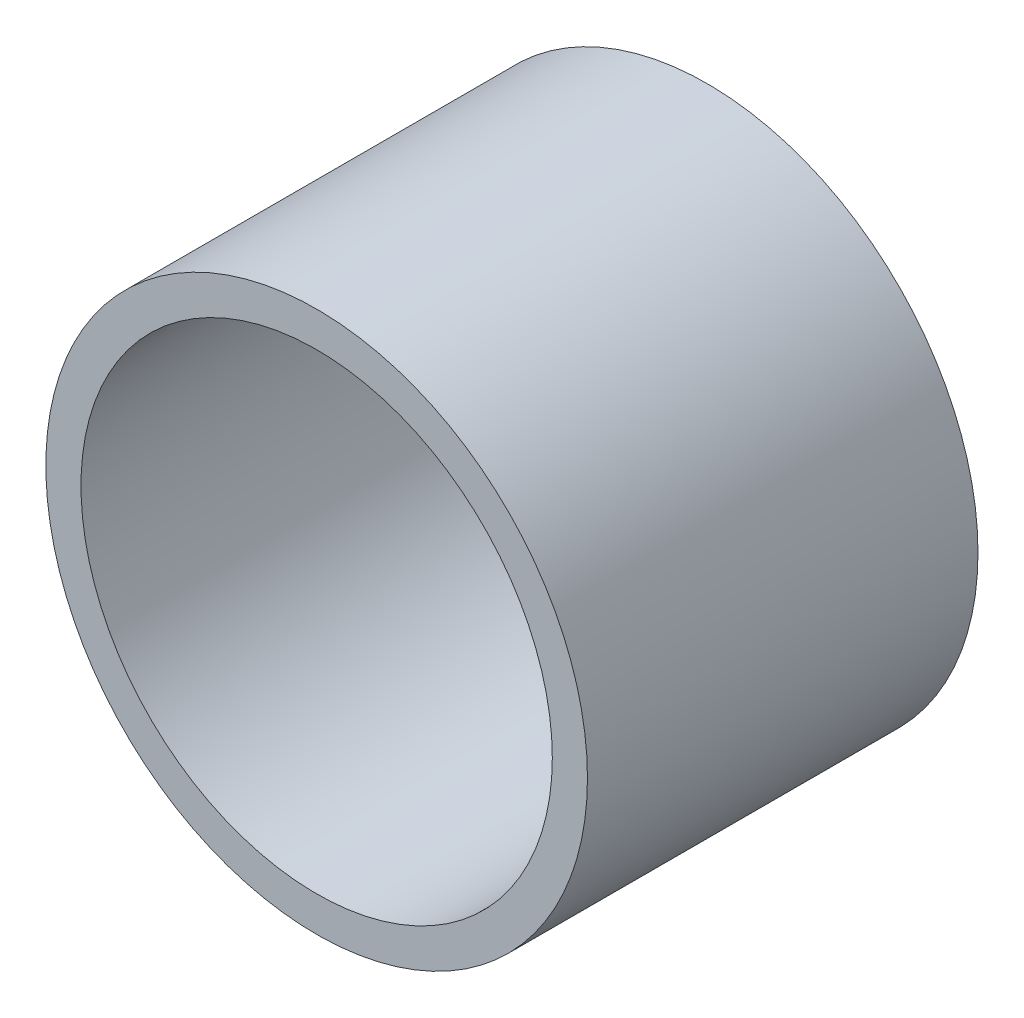
ISO-10303-21;
HEADER;
FILE_DESCRIPTION(('STEP AP214'),'2;1');
FILE_NAME('part.step','',(''),(''),'','','');
FILE_SCHEMA(('AUTOMOTIVE_DESIGN { 1 0 10303 214 1 1 1 1 }'));
ENDSEC;
DATA;
#1=APPLICATION_CONTEXT('core data for automotive mechanical design processes');
#2=APPLICATION_PROTOCOL_DEFINITION('international standard','automotive_design',2000,#1);
#3=PRODUCT_CONTEXT('',#1,'mechanical');
#4=PRODUCT('Part','Part','',(#3));
#5=PRODUCT_RELATED_PRODUCT_CATEGORY('part','',(#4));
#6=PRODUCT_DEFINITION_FORMATION('','',#4);
#7=PRODUCT_DEFINITION_CONTEXT('part definition',#1,'design');
#8=PRODUCT_DEFINITION('design','',#6,#7);
#9=PRODUCT_DEFINITION_SHAPE('','',#8);
#10=(LENGTH_UNIT() NAMED_UNIT(*) SI_UNIT(.MILLI.,.METRE.));
#11=(NAMED_UNIT(*) PLANE_ANGLE_UNIT() SI_UNIT($,.RADIAN.));
#12=(NAMED_UNIT(*) SI_UNIT($,.STERADIAN.) SOLID_ANGLE_UNIT());
#13=UNCERTAINTY_MEASURE_WITH_UNIT(LENGTH_MEASURE(1.E-05),#10,'distance_accuracy_value','');
#14=(GEOMETRIC_REPRESENTATION_CONTEXT(3) GLOBAL_UNCERTAINTY_ASSIGNED_CONTEXT((#13)) GLOBAL_UNIT_ASSIGNED_CONTEXT((#10,
#11,#12)) REPRESENTATION_CONTEXT('',''));
#15=CARTESIAN_POINT('',(0.,0.,0.));
#16=DIRECTION('',(0.,0.,1.));
#17=DIRECTION('',(1.,0.,0.));
#18=AXIS2_PLACEMENT_3D('',#15,#16,#17);
#19=CARTESIAN_POINT('',(0.,0.,43.5));
#20=DIRECTION('',(0.,0.,1.));
#21=DIRECTION('',(1.,0.,0.));
#22=AXIS2_PLACEMENT_3D('',#19,#20,#21);
#23=PLANE('',#22);
#24=CARTESIAN_POINT('',(0.,0.,43.5));
#25=DIRECTION('',(0.,0.,1.));
#26=DIRECTION('',(1.,0.,0.));
#27=AXIS2_PLACEMENT_3D('',#24,#25,#26);
#28=CIRCLE('',#27,30.165);
#29=CARTESIAN_POINT('',(30.165,0.,43.5));
#30=VERTEX_POINT('',#29);
#31=EDGE_CURVE('E10',#30,#30,#28,.T.);
#32=ORIENTED_EDGE('',*,*,#31,.T.);
#33=EDGE_LOOP('',(#32));
#34=FACE_BOUND('',#33,.T.);
#35=CARTESIAN_POINT('',(0.,0.,43.5));
#36=DIRECTION('',(0.,0.,1.));
#37=DIRECTION('',(1.,0.,0.));
#38=AXIS2_PLACEMENT_3D('',#35,#36,#37);
#39=CIRCLE('',#38,26.25);
#40=CARTESIAN_POINT('',(26.25,0.,43.5));
#41=VERTEX_POINT('',#40);
#42=EDGE_CURVE('E46',#41,#41,#39,.T.);
#43=ORIENTED_EDGE('',*,*,#42,.F.);
#44=EDGE_LOOP('',(#43));
#45=FACE_BOUND('',#44,.T.);
#46=ADVANCED_FACE('F35',(#34,#45),#23,.T.);
#47=CARTESIAN_POINT('',(0.,0.,0.));
#48=DIRECTION('',(0.,0.,1.));
#49=DIRECTION('',(1.,0.,0.));
#50=AXIS2_PLACEMENT_3D('',#47,#48,#49);
#51=PLANE('',#50);
#52=CARTESIAN_POINT('',(0.,0.,0.));
#53=DIRECTION('',(0.,0.,1.));
#54=DIRECTION('',(1.,0.,0.));
#55=AXIS2_PLACEMENT_3D('',#52,#53,#54);
#56=CIRCLE('',#55,30.165);
#57=CARTESIAN_POINT('',(30.165,0.,0.));
#58=VERTEX_POINT('',#57);
#59=EDGE_CURVE('E39',#58,#58,#56,.T.);
#60=ORIENTED_EDGE('',*,*,#59,.F.);
#61=EDGE_LOOP('',(#60));
#62=FACE_BOUND('',#61,.T.);
#63=CARTESIAN_POINT('',(0.,0.,0.));
#64=DIRECTION('',(0.,0.,1.));
#65=DIRECTION('',(1.,0.,0.));
#66=AXIS2_PLACEMENT_3D('',#63,#64,#65);
#67=CIRCLE('',#66,26.25);
#68=CARTESIAN_POINT('',(26.25,0.,0.));
#69=VERTEX_POINT('',#68);
#70=EDGE_CURVE('E48',#69,#69,#67,.T.);
#71=ORIENTED_EDGE('',*,*,#70,.T.);
#72=EDGE_LOOP('',(#71));
#73=FACE_BOUND('',#72,.T.);
#74=ADVANCED_FACE('F58',(#62,#73),#51,.F.);
#75=CARTESIAN_POINT('',(0.,0.,43.5));
#76=DIRECTION('',(0.,0.,-1.));
#77=DIRECTION('',(-1.,0.,0.));
#78=AXIS2_PLACEMENT_3D('',#75,#76,#77);
#79=CYLINDRICAL_SURFACE('',#78,30.165);
#80=ORIENTED_EDGE('',*,*,#31,.F.);
#81=EDGE_LOOP('',(#80));
#82=FACE_BOUND('',#81,.T.);
#83=ORIENTED_EDGE('',*,*,#59,.T.);
#84=EDGE_LOOP('',(#83));
#85=FACE_BOUND('',#84,.T.);
#86=ADVANCED_FACE('F37',(#82,#85),#79,.T.);
#87=CARTESIAN_POINT('',(0.,0.,43.5));
#88=DIRECTION('',(0.,0.,-1.));
#89=DIRECTION('',(-1.,0.,0.));
#90=AXIS2_PLACEMENT_3D('',#87,#88,#89);
#91=CYLINDRICAL_SURFACE('',#90,26.25);
#92=ORIENTED_EDGE('',*,*,#42,.T.);
#93=EDGE_LOOP('',(#92));
#94=FACE_BOUND('',#93,.T.);
#95=ORIENTED_EDGE('',*,*,#70,.F.);
#96=EDGE_LOOP('',(#95));
#97=FACE_BOUND('',#96,.T.);
#98=ADVANCED_FACE('F54',(#94,#97),#91,.F.);
#99=CLOSED_SHELL('',(#46,#74,#86,#98));
#100=MANIFOLD_SOLID_BREP('B2',#99);
#101=ADVANCED_BREP_SHAPE_REPRESENTATION('',(#18,#100),#14);
#102=SHAPE_DEFINITION_REPRESENTATION(#9,#101);
ENDSEC;
END-ISO-10303-21;
